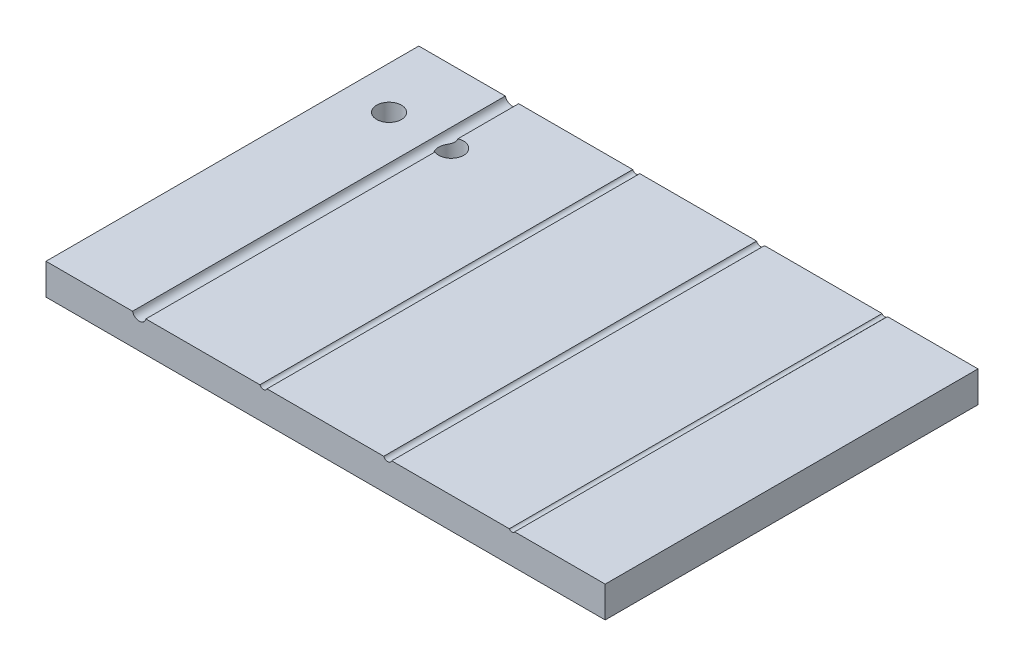
ISO-10303-21;
HEADER;
FILE_DESCRIPTION(('STEP AP214'),'2;1');
FILE_NAME('part.step','',(''),(''),'','','');
FILE_SCHEMA(('AUTOMOTIVE_DESIGN { 1 0 10303 214 1 1 1 1 }'));
ENDSEC;
DATA;
#1=APPLICATION_CONTEXT('core data for automotive mechanical design processes');
#2=APPLICATION_PROTOCOL_DEFINITION('international standard','automotive_design',2000,#1);
#3=PRODUCT_CONTEXT('',#1,'mechanical');
#4=PRODUCT('Part','Part','',(#3));
#5=PRODUCT_RELATED_PRODUCT_CATEGORY('part','',(#4));
#6=PRODUCT_DEFINITION_FORMATION('','',#4);
#7=PRODUCT_DEFINITION_CONTEXT('part definition',#1,'design');
#8=PRODUCT_DEFINITION('design','',#6,#7);
#9=PRODUCT_DEFINITION_SHAPE('','',#8);
#10=(LENGTH_UNIT() NAMED_UNIT(*) SI_UNIT(.MILLI.,.METRE.));
#11=(NAMED_UNIT(*) PLANE_ANGLE_UNIT() SI_UNIT($,.RADIAN.));
#12=(NAMED_UNIT(*) SI_UNIT($,.STERADIAN.) SOLID_ANGLE_UNIT());
#13=UNCERTAINTY_MEASURE_WITH_UNIT(LENGTH_MEASURE(1.E-05),#10,'distance_accuracy_value','');
#14=(GEOMETRIC_REPRESENTATION_CONTEXT(3) GLOBAL_UNCERTAINTY_ASSIGNED_CONTEXT((#13)) GLOBAL_UNIT_ASSIGNED_CONTEXT((#10,
#11,#12)) REPRESENTATION_CONTEXT('',''));
#15=CARTESIAN_POINT('',(0.,0.,0.));
#16=DIRECTION('',(0.,0.,1.));
#17=DIRECTION('',(1.,0.,0.));
#18=AXIS2_PLACEMENT_3D('',#15,#16,#17);
#19=CARTESIAN_POINT('',(0.,5.,0.));
#20=DIRECTION('',(0.,1.,0.));
#21=DIRECTION('',(0.,0.,1.));
#22=AXIS2_PLACEMENT_3D('',#19,#20,#21);
#23=PLANE('',#22);
#24=DIRECTION('',(0.,0.,1.));
#25=VECTOR('',#24,1.);
#26=CARTESIAN_POINT('',(-6.39332612607132,5.,-92.0754716981132));
#27=LINE('',#26,#25);
#28=CARTESIAN_POINT('',(-6.39332612607132,5.,-92.0754716981132));
#29=VERTEX_POINT('',#28);
#30=CARTESIAN_POINT('',(-6.39332612607132,5.,-32.0754716981132));
#31=VERTEX_POINT('',#30);
#32=EDGE_CURVE('E184',#29,#31,#27,.T.);
#33=ORIENTED_EDGE('',*,*,#32,.F.);
#34=DIRECTION('',(-1.,0.,0.));
#35=VECTOR('',#34,1.);
#36=CARTESIAN_POINT('',(-60.7547169811321,5.,-92.0754716981132));
#37=LINE('',#36,#35);
#38=CARTESIAN_POINT('',(-25.1873546630319,5.,-92.0754716981132));
#39=VERTEX_POINT('',#38);
#40=EDGE_CURVE('E211',#29,#39,#37,.T.);
#41=ORIENTED_EDGE('',*,*,#40,.T.);
#42=DIRECTION('',(0.,0.,1.));
#43=VECTOR('',#42,1.);
#44=CARTESIAN_POINT('',(-25.1873546630319,5.,-92.0754716981132));
#45=LINE('',#44,#43);
#46=CARTESIAN_POINT('',(-25.187354663032,5.,-32.0754716981132));
#47=VERTEX_POINT('',#46);
#48=EDGE_CURVE('E148',#47,#39,#45,.F.);
#49=ORIENTED_EDGE('',*,*,#48,.F.);
#50=DIRECTION('',(1.,0.,0.));
#51=VECTOR('',#50,1.);
#52=CARTESIAN_POINT('',(-60.7547169811321,5.,-32.0754716981132));
#53=LINE('',#52,#51);
#54=EDGE_CURVE('E245',#47,#31,#53,.T.);
#55=ORIENTED_EDGE('',*,*,#54,.T.);
#56=EDGE_LOOP('',(#33,#41,#49,#55));
#57=FACE_BOUND('',#56,.T.);
#58=ADVANCED_FACE('F33',(#57),#23,.T.);
#59=DIRECTION('',(0.,0.,1.));
#60=VECTOR('',#59,1.);
#61=CARTESIAN_POINT('',(-5.11610783619289,5.,-92.0754716981132));
#62=LINE('',#61,#60);
#63=CARTESIAN_POINT('',(-5.11610783619289,5.,-32.0754716981132));
#64=VERTEX_POINT('',#63);
#65=CARTESIAN_POINT('',(-5.11610783619289,5.,-92.0754716981132));
#66=VERTEX_POINT('',#65);
#67=EDGE_CURVE('E59',#64,#66,#62,.F.);
#68=ORIENTED_EDGE('',*,*,#67,.F.);
#69=CARTESIAN_POINT('',(13.8122703169757,5.,-32.0754716981132));
#70=VERTEX_POINT('',#69);
#71=EDGE_CURVE('E176',#64,#70,#53,.T.);
#72=ORIENTED_EDGE('',*,*,#71,.T.);
#73=DIRECTION('',(0.,0.,1.));
#74=VECTOR('',#73,1.);
#75=CARTESIAN_POINT('',(13.8122703169757,5.,-92.0754716981132));
#76=LINE('',#75,#74);
#77=CARTESIAN_POINT('',(13.8122703169757,5.,-92.0754716981132));
#78=VERTEX_POINT('',#77);
#79=EDGE_CURVE('E46',#78,#70,#76,.T.);
#80=ORIENTED_EDGE('',*,*,#79,.F.);
#81=EDGE_CURVE('E210',#78,#66,#37,.T.);
#82=ORIENTED_EDGE('',*,*,#81,.T.);
#83=EDGE_LOOP('',(#68,#72,#80,#82));
#84=FACE_BOUND('',#83,.T.);
#85=ADVANCED_FACE('F268',(#84),#23,.T.);
#86=CARTESIAN_POINT('',(-43.9074445790177,5.,-80.4423119631146));
#87=DIRECTION('',(0.,1.,0.));
#88=DIRECTION('',(0.,0.,1.));
#89=AXIS2_PLACEMENT_3D('',#86,#87,#88);
#90=CIRCLE('',#89,2.);
#91=CARTESIAN_POINT('',(-44.6835027168507,5.,-78.5990176928736));
#92=VERTEX_POINT('',#91);
#93=CARTESIAN_POINT('',(-44.6835027168507,5.,-82.2856062333556));
#94=VERTEX_POINT('',#93);
#95=EDGE_CURVE('E52',#92,#94,#90,.T.);
#96=ORIENTED_EDGE('',*,*,#95,.F.);
#97=DIRECTION('',(0.,0.,1.));
#98=VECTOR('',#97,1.);
#99=CARTESIAN_POINT('',(-44.6835027168507,5.,-92.0754716981132));
#100=LINE('',#99,#98);
#101=CARTESIAN_POINT('',(-44.6835027168507,5.,-32.0754716981132));
#102=VERTEX_POINT('',#101);
#103=EDGE_CURVE('E137',#102,#92,#100,.F.);
#104=ORIENTED_EDGE('',*,*,#103,.F.);
#105=CARTESIAN_POINT('',(-26.3220792992323,5.,-32.0754716981132));
#106=VERTEX_POINT('',#105);
#107=EDGE_CURVE('E203',#102,#106,#53,.T.);
#108=ORIENTED_EDGE('',*,*,#107,.T.);
#109=DIRECTION('',(0.,0.,1.));
#110=VECTOR('',#109,1.);
#111=CARTESIAN_POINT('',(-26.3220792992323,5.,-92.0754716981132));
#112=LINE('',#111,#110);
#113=CARTESIAN_POINT('',(-26.3220792992323,5.,-92.0754716981132));
#114=VERTEX_POINT('',#113);
#115=EDGE_CURVE('E156',#114,#106,#112,.T.);
#116=ORIENTED_EDGE('',*,*,#115,.F.);
#117=CARTESIAN_POINT('',(-44.6835027168507,5.,-92.0754716981132));
#118=VERTEX_POINT('',#117);
#119=EDGE_CURVE('E256',#114,#118,#37,.T.);
#120=ORIENTED_EDGE('',*,*,#119,.T.);
#121=EDGE_CURVE('E140',#94,#118,#100,.F.);
#122=ORIENTED_EDGE('',*,*,#121,.F.);
#123=EDGE_LOOP('',(#96,#104,#108,#116,#120,#122));
#124=FACE_BOUND('',#123,.T.);
#125=ADVANCED_FACE('F135',(#124),#23,.T.);
#126=CARTESIAN_POINT('',(-53.9074445790177,5.,-80.4423119631146));
#127=DIRECTION('',(0.,1.,0.));
#128=DIRECTION('',(0.,0.,1.));
#129=AXIS2_PLACEMENT_3D('',#126,#127,#128);
#130=CIRCLE('',#129,2.);
#131=CARTESIAN_POINT('',(-53.9074445790177,5.,-78.4423119631146));
#132=VERTEX_POINT('',#131);
#133=EDGE_CURVE('E284',#132,#132,#130,.T.);
#134=ORIENTED_EDGE('',*,*,#133,.F.);
#135=EDGE_LOOP('',(#134));
#136=FACE_BOUND('',#135,.T.);
#137=DIRECTION('',(0.,0.,1.));
#138=VECTOR('',#137,1.);
#139=CARTESIAN_POINT('',(-46.8259312454135,5.,-92.0754716981132));
#140=LINE('',#139,#138);
#141=CARTESIAN_POINT('',(-46.8259312454135,5.,-92.0754716981132));
#142=VERTEX_POINT('',#141);
#143=CARTESIAN_POINT('',(-46.8259312454135,5.,-32.0754716981132));
#144=VERTEX_POINT('',#143);
#145=EDGE_CURVE('E146',#142,#144,#140,.T.);
#146=ORIENTED_EDGE('',*,*,#145,.F.);
#147=CARTESIAN_POINT('',(-60.7547169811321,5.,-92.0754716981132));
#148=VERTEX_POINT('',#147);
#149=EDGE_CURVE('E205',#142,#148,#37,.T.);
#150=ORIENTED_EDGE('',*,*,#149,.T.);
#151=DIRECTION('',(0.,0.,1.));
#152=VECTOR('',#151,1.);
#153=CARTESIAN_POINT('',(-60.7547169811321,5.,-92.0754716981132));
#154=LINE('',#153,#152);
#155=CARTESIAN_POINT('',(-60.7547169811321,5.,-32.0754716981132));
#156=VERTEX_POINT('',#155);
#157=EDGE_CURVE('E195',#148,#156,#154,.T.);
#158=ORIENTED_EDGE('',*,*,#157,.T.);
#159=EDGE_CURVE('E199',#156,#144,#53,.T.);
#160=ORIENTED_EDGE('',*,*,#159,.T.);
#161=EDGE_LOOP('',(#146,#150,#158,#160));
#162=FACE_BOUND('',#161,.T.);
#163=ADVANCED_FACE('F260',(#136,#162),#23,.T.);
#164=CARTESIAN_POINT('',(-60.7547169811321,5.,-92.0754716981132));
#165=DIRECTION('',(1.,0.,0.));
#166=DIRECTION('',(0.,0.,-1.));
#167=AXIS2_PLACEMENT_3D('',#164,#165,#166);
#168=PLANE('',#167);
#169=DIRECTION('',(0.,0.,1.));
#170=VECTOR('',#169,1.);
#171=CARTESIAN_POINT('',(-60.7547169811321,0.,-92.0754716981132));
#172=LINE('',#171,#170);
#173=CARTESIAN_POINT('',(-60.7547169811321,0.,-92.0754716981132));
#174=VERTEX_POINT('',#173);
#175=CARTESIAN_POINT('',(-60.7547169811321,0.,-32.0754716981132));
#176=VERTEX_POINT('',#175);
#177=EDGE_CURVE('E193',#174,#176,#172,.T.);
#178=ORIENTED_EDGE('',*,*,#177,.T.);
#179=DIRECTION('',(0.,-1.,0.));
#180=VECTOR('',#179,1.);
#181=CARTESIAN_POINT('',(-60.7547169811321,5.,-32.0754716981132));
#182=LINE('',#181,#180);
#183=EDGE_CURVE('E150',#156,#176,#182,.T.);
#184=ORIENTED_EDGE('',*,*,#183,.F.);
#185=ORIENTED_EDGE('',*,*,#157,.F.);
#186=DIRECTION('',(0.,-1.,0.));
#187=VECTOR('',#186,1.);
#188=CARTESIAN_POINT('',(-60.7547169811321,5.,-92.0754716981132));
#189=LINE('',#188,#187);
#190=EDGE_CURVE('E209',#148,#174,#189,.T.);
#191=ORIENTED_EDGE('',*,*,#190,.T.);
#192=EDGE_LOOP('',(#178,#184,#185,#191));
#193=FACE_BOUND('',#192,.T.);
#194=ADVANCED_FACE('F35',(#193),#168,.F.);
#195=CARTESIAN_POINT('',(-60.7547169811321,5.,-32.0754716981132));
#196=DIRECTION('',(0.,0.,-1.));
#197=DIRECTION('',(-1.,0.,0.));
#198=AXIS2_PLACEMENT_3D('',#195,#196,#197);
#199=PLANE('',#198);
#200=ORIENTED_EDGE('',*,*,#71,.F.);
#201=CARTESIAN_POINT('',(-5.75471698113211,5.25,-32.0754716981132));
#202=DIRECTION('',(0.,0.,1.));
#203=DIRECTION('',(1.,0.,0.));
#204=AXIS2_PLACEMENT_3D('',#201,#202,#203);
#205=CIRCLE('',#204,0.6858);
#206=EDGE_CURVE('E278',#31,#64,#205,.T.);
#207=ORIENTED_EDGE('',*,*,#206,.F.);
#208=ORIENTED_EDGE('',*,*,#54,.F.);
#209=CARTESIAN_POINT('',(-25.7547169811321,5.25,-32.0754716981132));
#210=DIRECTION('',(0.,0.,1.));
#211=DIRECTION('',(1.,0.,0.));
#212=AXIS2_PLACEMENT_3D('',#209,#210,#211);
#213=CIRCLE('',#212,0.62);
#214=EDGE_CURVE('E182',#106,#47,#213,.T.);
#215=ORIENTED_EDGE('',*,*,#214,.F.);
#216=ORIENTED_EDGE('',*,*,#107,.F.);
#217=CARTESIAN_POINT('',(-45.7547169811321,5.25,-32.0754716981132));
#218=DIRECTION('',(0.,0.,1.));
#219=DIRECTION('',(1.,0.,0.));
#220=AXIS2_PLACEMENT_3D('',#217,#218,#219);
#221=CIRCLE('',#220,1.1);
#222=EDGE_CURVE('E145',#144,#102,#221,.T.);
#223=ORIENTED_EDGE('',*,*,#222,.F.);
#224=ORIENTED_EDGE('',*,*,#159,.F.);
#225=ORIENTED_EDGE('',*,*,#183,.T.);
#226=DIRECTION('',(1.,0.,0.));
#227=VECTOR('',#226,1.);
#228=CARTESIAN_POINT('',(-60.7547169811321,0.,-32.0754716981132));
#229=LINE('',#228,#227);
#230=CARTESIAN_POINT('',(29.2452830188679,0.,-32.0754716981132));
#231=VERTEX_POINT('',#230);
#232=EDGE_CURVE('E214',#176,#231,#229,.T.);
#233=ORIENTED_EDGE('',*,*,#232,.T.);
#234=DIRECTION('',(0.,-1.,0.));
#235=VECTOR('',#234,1.);
#236=CARTESIAN_POINT('',(29.2452830188679,5.,-32.0754716981132));
#237=LINE('',#236,#235);
#238=CARTESIAN_POINT('',(29.2452830188679,5.,-32.0754716981132));
#239=VERTEX_POINT('',#238);
#240=EDGE_CURVE('E223',#239,#231,#237,.T.);
#241=ORIENTED_EDGE('',*,*,#240,.F.);
#242=CARTESIAN_POINT('',(14.6782957207601,5.,-32.0754716981132));
#243=VERTEX_POINT('',#242);
#244=EDGE_CURVE('E178',#243,#239,#53,.T.);
#245=ORIENTED_EDGE('',*,*,#244,.F.);
#246=CARTESIAN_POINT('',(14.2452830188679,5.25,-32.0754716981132));
#247=DIRECTION('',(0.,0.,1.));
#248=DIRECTION('',(1.,0.,0.));
#249=AXIS2_PLACEMENT_3D('',#246,#247,#248);
#250=CIRCLE('',#249,0.499999999999999);
#251=EDGE_CURVE('E164',#70,#243,#250,.T.);
#252=ORIENTED_EDGE('',*,*,#251,.F.);
#253=EDGE_LOOP('',(#200,#207,#208,#215,#216,#223,#224,#225,#233,#241,#245,#252));
#254=FACE_BOUND('',#253,.T.);
#255=ADVANCED_FACE('F174',(#254),#199,.F.);
#256=CARTESIAN_POINT('',(29.2452830188679,5.,-92.0754716981132));
#257=DIRECTION('',(-1.,0.,0.));
#258=DIRECTION('',(0.,0.,1.));
#259=AXIS2_PLACEMENT_3D('',#256,#257,#258);
#260=PLANE('',#259);
#261=DIRECTION('',(0.,0.,-1.));
#262=VECTOR('',#261,1.);
#263=CARTESIAN_POINT('',(29.2452830188679,0.,-92.0754716981132));
#264=LINE('',#263,#262);
#265=CARTESIAN_POINT('',(29.2452830188679,0.,-92.0754716981132));
#266=VERTEX_POINT('',#265);
#267=EDGE_CURVE('E216',#231,#266,#264,.T.);
#268=ORIENTED_EDGE('',*,*,#267,.T.);
#269=DIRECTION('',(0.,-1.,0.));
#270=VECTOR('',#269,1.);
#271=CARTESIAN_POINT('',(29.2452830188679,5.,-92.0754716981132));
#272=LINE('',#271,#270);
#273=CARTESIAN_POINT('',(29.2452830188679,5.,-92.0754716981132));
#274=VERTEX_POINT('',#273);
#275=EDGE_CURVE('E221',#274,#266,#272,.T.);
#276=ORIENTED_EDGE('',*,*,#275,.F.);
#277=DIRECTION('',(0.,0.,-1.));
#278=VECTOR('',#277,1.);
#279=CARTESIAN_POINT('',(29.2452830188679,5.,-92.0754716981132));
#280=LINE('',#279,#278);
#281=EDGE_CURVE('E202',#239,#274,#280,.T.);
#282=ORIENTED_EDGE('',*,*,#281,.F.);
#283=ORIENTED_EDGE('',*,*,#240,.T.);
#284=EDGE_LOOP('',(#268,#276,#282,#283));
#285=FACE_BOUND('',#284,.T.);
#286=ADVANCED_FACE('F238',(#285),#260,.F.);
#287=CARTESIAN_POINT('',(-60.7547169811321,5.,-92.0754716981132));
#288=DIRECTION('',(0.,0.,1.));
#289=DIRECTION('',(1.,0.,0.));
#290=AXIS2_PLACEMENT_3D('',#287,#288,#289);
#291=PLANE('',#290);
#292=ORIENTED_EDGE('',*,*,#40,.F.);
#293=CARTESIAN_POINT('',(-5.75471698113211,5.25,-92.0754716981132));
#294=DIRECTION('',(0.,0.,1.));
#295=DIRECTION('',(1.,0.,0.));
#296=AXIS2_PLACEMENT_3D('',#293,#294,#295);
#297=CIRCLE('',#296,0.6858);
#298=EDGE_CURVE('E279',#29,#66,#297,.T.);
#299=ORIENTED_EDGE('',*,*,#298,.T.);
#300=ORIENTED_EDGE('',*,*,#81,.F.);
#301=CARTESIAN_POINT('',(14.2452830188679,5.25,-92.0754716981132));
#302=DIRECTION('',(0.,0.,1.));
#303=DIRECTION('',(1.,0.,0.));
#304=AXIS2_PLACEMENT_3D('',#301,#302,#303);
#305=CIRCLE('',#304,0.499999999999999);
#306=CARTESIAN_POINT('',(14.6782957207601,5.,-92.0754716981132));
#307=VERTEX_POINT('',#306);
#308=EDGE_CURVE('E167',#78,#307,#305,.T.);
#309=ORIENTED_EDGE('',*,*,#308,.T.);
#310=EDGE_CURVE('E206',#274,#307,#37,.T.);
#311=ORIENTED_EDGE('',*,*,#310,.F.);
#312=ORIENTED_EDGE('',*,*,#275,.T.);
#313=DIRECTION('',(-1.,0.,0.));
#314=VECTOR('',#313,1.);
#315=CARTESIAN_POINT('',(-60.7547169811321,0.,-92.0754716981132));
#316=LINE('',#315,#314);
#317=EDGE_CURVE('E198',#266,#174,#316,.T.);
#318=ORIENTED_EDGE('',*,*,#317,.T.);
#319=ORIENTED_EDGE('',*,*,#190,.F.);
#320=ORIENTED_EDGE('',*,*,#149,.F.);
#321=CARTESIAN_POINT('',(-45.7547169811321,5.25,-92.0754716981132));
#322=DIRECTION('',(0.,0.,1.));
#323=DIRECTION('',(1.,0.,0.));
#324=AXIS2_PLACEMENT_3D('',#321,#322,#323);
#325=CIRCLE('',#324,1.1);
#326=EDGE_CURVE('E190',#142,#118,#325,.T.);
#327=ORIENTED_EDGE('',*,*,#326,.T.);
#328=ORIENTED_EDGE('',*,*,#119,.F.);
#329=CARTESIAN_POINT('',(-25.7547169811321,5.25,-92.0754716981132));
#330=DIRECTION('',(0.,0.,1.));
#331=DIRECTION('',(1.,0.,0.));
#332=AXIS2_PLACEMENT_3D('',#329,#330,#331);
#333=CIRCLE('',#332,0.62);
#334=EDGE_CURVE('E179',#114,#39,#333,.T.);
#335=ORIENTED_EDGE('',*,*,#334,.T.);
#336=EDGE_LOOP('',(#292,#299,#300,#309,#311,#312,#318,#319,#320,#327,#328,#335));
#337=FACE_BOUND('',#336,.T.);
#338=ADVANCED_FACE('F242',(#337),#291,.F.);
#339=DIRECTION('',(0.,0.,1.));
#340=VECTOR('',#339,1.);
#341=CARTESIAN_POINT('',(14.6782957207601,5.,-92.0754716981132));
#342=LINE('',#341,#340);
#343=EDGE_CURVE('E158',#243,#307,#342,.F.);
#344=ORIENTED_EDGE('',*,*,#343,.F.);
#345=ORIENTED_EDGE('',*,*,#244,.T.);
#346=ORIENTED_EDGE('',*,*,#281,.T.);
#347=ORIENTED_EDGE('',*,*,#310,.T.);
#348=EDGE_LOOP('',(#344,#345,#346,#347));
#349=FACE_BOUND('',#348,.T.);
#350=ADVANCED_FACE('F244',(#349),#23,.T.);
#351=CARTESIAN_POINT('',(0.,0.,0.));
#352=DIRECTION('',(0.,1.,0.));
#353=DIRECTION('',(0.,0.,1.));
#354=AXIS2_PLACEMENT_3D('',#351,#352,#353);
#355=PLANE('',#354);
#356=CARTESIAN_POINT('',(-43.9074445790177,0.,-80.4423119631146));
#357=DIRECTION('',(0.,1.,0.));
#358=DIRECTION('',(0.,0.,1.));
#359=AXIS2_PLACEMENT_3D('',#356,#357,#358);
#360=CIRCLE('',#359,2.);
#361=CARTESIAN_POINT('',(-43.9074445790177,0.,-78.4423119631146));
#362=VERTEX_POINT('',#361);
#363=EDGE_CURVE('E141',#362,#362,#360,.T.);
#364=ORIENTED_EDGE('',*,*,#363,.T.);
#365=EDGE_LOOP('',(#364));
#366=FACE_BOUND('',#365,.T.);
#367=CARTESIAN_POINT('',(-53.9074445790177,0.,-80.4423119631146));
#368=DIRECTION('',(0.,1.,0.));
#369=DIRECTION('',(0.,0.,1.));
#370=AXIS2_PLACEMENT_3D('',#367,#368,#369);
#371=CIRCLE('',#370,2.);
#372=CARTESIAN_POINT('',(-53.9074445790177,0.,-78.4423119631146));
#373=VERTEX_POINT('',#372);
#374=EDGE_CURVE('E282',#373,#373,#371,.T.);
#375=ORIENTED_EDGE('',*,*,#374,.T.);
#376=EDGE_LOOP('',(#375));
#377=FACE_BOUND('',#376,.T.);
#378=ORIENTED_EDGE('',*,*,#177,.F.);
#379=ORIENTED_EDGE('',*,*,#317,.F.);
#380=ORIENTED_EDGE('',*,*,#267,.F.);
#381=ORIENTED_EDGE('',*,*,#232,.F.);
#382=EDGE_LOOP('',(#378,#379,#380,#381));
#383=FACE_BOUND('',#382,.T.);
#384=ADVANCED_FACE('F236',(#366,#377,#383),#355,.F.);
#385=CARTESIAN_POINT('',(-45.7547169811321,5.25,-92.0754716981132));
#386=DIRECTION('',(0.,0.,1.));
#387=DIRECTION('',(1.,0.,0.));
#388=AXIS2_PLACEMENT_3D('',#385,#386,#387);
#389=CYLINDRICAL_SURFACE('',#388,1.1);
#390=ORIENTED_EDGE('',*,*,#103,.T.);
#391=CARTESIAN_POINT('',(-44.6835027168507,5.,-78.5990176928736));
#392=CARTESIAN_POINT('',(-44.6899202354543,4.97249693888929,-78.6017229261327));
#393=CARTESIAN_POINT('',(-44.6973867702952,4.94529859888722,-78.6049023768884));
#394=CARTESIAN_POINT('',(-44.7143340497925,4.89167834483306,-78.6122798460931));
#395=CARTESIAN_POINT('',(-44.7238148300667,4.86525644452006,-78.6164778825538));
#396=CARTESIAN_POINT('',(-44.755105212997,4.78752456299856,-78.630683482873));
#397=CARTESIAN_POINT('',(-44.7797926277288,4.73762265022467,-78.6423141367367));
#398=CARTESIAN_POINT('',(-44.8356633236478,4.64307073078245,-78.6704812366692));
#399=CARTESIAN_POINT('',(-44.8668541361028,4.59842690788634,-78.6870233799952));
#400=CARTESIAN_POINT('',(-44.9340600321087,4.51558603733215,-78.7254679644335));
#401=CARTESIAN_POINT('',(-44.9700722476337,4.47738518734798,-78.7473672252057));
#402=CARTESIAN_POINT('',(-45.0448852429407,4.40813654534841,-78.7966430804185));
#403=CARTESIAN_POINT('',(-45.083679602505,4.37707293839956,-78.824007308718));
#404=CARTESIAN_POINT('',(-45.1621472410909,4.32201144625727,-78.8840552738125));
#405=CARTESIAN_POINT('',(-45.2018209620422,4.29801720455781,-78.9167417402191));
#406=CARTESIAN_POINT('',(-45.2833585952313,4.25495544666789,-78.9897005794939));
#407=CARTESIAN_POINT('',(-45.3251495151025,4.2364234898411,-79.0303672923556));
#408=CARTESIAN_POINT('',(-45.4060264918933,4.20583149136189,-79.1165073695616));
#409=CARTESIAN_POINT('',(-45.4451106677455,4.19377591195951,-79.1619840222181));
#410=CARTESIAN_POINT('',(-45.5401750325229,4.16946638099021,-79.2834403906024));
#411=CARTESIAN_POINT('',(-45.5934272684518,4.16084872390531,-79.3622912314042));
#412=CARTESIAN_POINT('',(-45.6883376645623,4.15096324643832,-79.5271453354249));
#413=CARTESIAN_POINT('',(-45.7299698932094,4.14971174159816,-79.6131640482974));
#414=CARTESIAN_POINT('',(-45.8014356155745,4.15039781180992,-79.79243594328));
#415=CARTESIAN_POINT('',(-45.8309471771439,4.15241611706885,-79.8858164244188));
#416=CARTESIAN_POINT('',(-45.8760021880223,4.15646826533132,-80.0758408929611));
#417=CARTESIAN_POINT('',(-45.8915563491759,4.1585020952091,-80.1724823184876));
#418=CARTESIAN_POINT('',(-45.9048245363375,4.16028450586061,-80.3255758310919));
#419=CARTESIAN_POINT('',(-45.9073116441858,4.16063701658732,-80.3816480328067));
#420=CARTESIAN_POINT('',(-45.9075670344482,4.16066990581624,-80.493819774386));
#421=CARTESIAN_POINT('',(-45.9053348410977,4.16035021655232,-80.5499193164366));
#422=CARTESIAN_POINT('',(-45.8961593748739,4.15912213948255,-80.6617827628682));
#423=CARTESIAN_POINT('',(-45.889211024418,4.15821311722717,-80.7175462400809));
#424=CARTESIAN_POINT('',(-45.8706468658426,4.15608611250328,-80.8283051069353));
#425=CARTESIAN_POINT('',(-45.8590294048463,4.15486802067973,-80.8833002174317));
#426=CARTESIAN_POINT('',(-45.8312335952536,4.15257619647291,-80.9920192196193));
#427=CARTESIAN_POINT('',(-45.8150638205139,4.15150219826428,-81.045745297189));
#428=CARTESIAN_POINT('',(-45.7782657803961,4.15009803766131,-81.1516572926586));
#429=CARTESIAN_POINT('',(-45.7576377806034,4.14976783097118,-81.203843302093));
#430=CARTESIAN_POINT('',(-45.7120999685696,4.15059033186999,-81.3062288040314));
#431=CARTESIAN_POINT('',(-45.6871958139751,4.15174109293959,-81.3564308148927));
#432=CARTESIAN_POINT('',(-45.6333276758143,4.15638463255587,-81.4544661789247));
#433=CARTESIAN_POINT('',(-45.6043656120621,4.15987630654635,-81.5023006377957));
#434=CARTESIAN_POINT('',(-45.532000158388,4.17195876389753,-81.6112601349317));
#435=CARTESIAN_POINT('',(-45.4870696321163,4.18189694784902,-81.6712488953091));
#436=CARTESIAN_POINT('',(-45.3919274807122,4.2103674383514,-81.7846086866571));
#437=CARTESIAN_POINT('',(-45.3417248915953,4.22888522003151,-81.8379907097486));
#438=CARTESIAN_POINT('',(-45.2477124418387,4.27268840670512,-81.9279586829939));
#439=CARTESIAN_POINT('',(-45.2043347377399,4.29620651159792,-81.9658467894784));
#440=CARTESIAN_POINT('',(-45.1179071663152,4.35161233431556,-82.0353749958531));
#441=CARTESIAN_POINT('',(-45.0748570664194,4.38349340435574,-82.0670200235631));
#442=CARTESIAN_POINT('',(-44.9914382966377,4.45597926671951,-82.1238359299624));
#443=CARTESIAN_POINT('',(-44.9510833409129,4.49662479389405,-82.1489753291886));
#444=CARTESIAN_POINT('',(-44.8759084585409,4.58584624005723,-82.1927345045864));
#445=CARTESIAN_POINT('',(-44.8410920769248,4.63442719822214,-82.2113501142231));
#446=CARTESIAN_POINT('',(-44.7816457708162,4.73402533071047,-82.2414230819583));
#447=CARTESIAN_POINT('',(-44.756435455643,4.78456179206419,-82.2533234446319));
#448=CARTESIAN_POINT('',(-44.7245197894442,4.86334406647258,-82.2678320956828));
#449=CARTESIAN_POINT('',(-44.7148576340438,4.890130218124,-82.2721140127344));
#450=CARTESIAN_POINT('',(-44.6976043067079,4.94450646684998,-82.279628838098));
#451=CARTESIAN_POINT('',(-44.6900132476803,4.97209660766408,-82.282861689221));
#452=CARTESIAN_POINT('',(-44.6835027168507,5.,-82.2856062333556));
#453=B_SPLINE_CURVE_WITH_KNOTS('',3,(#391,#392,#393,#394,#395,#396,#397,#398,#399,#400,#401,
#402,#403,#404,#405,#406,#407,#408,#409,#410,#411,#412,#413,#414,#415,#416,#417,#418,#419,#420,
#421,#422,#423,#424,#425,#426,#427,#428,#429,#430,#431,#432,#433,#434,#435,#436,#437,#438,#439,
#440,#441,#442,#443,#444,#445,#446,#447,#448,#449,#450,#451,#452),.UNSPECIFIED.,.F.,.F.,(4,2,2,
2,2,2,2,2,2,2,2,2,2,2,2,2,2,2,2,2,2,2,2,2,2,2,2,2,2,2,4),(0.,0.0850623500026699,
0.170126204279844,0.339869636160493,0.50981074241212,0.679651204161093,0.849111618316892,
1.01865921883604,1.20153488381798,1.38453638978567,1.66956037222128,1.9552154271306,
2.24803127424552,2.5406222021751,2.70883063436269,2.87705602486724,3.04546282070592,
3.21392928555133,3.38208055815008,3.5502218163979,3.71814230266027,3.88598361160893,
4.11196799339067,4.33757118399132,4.52342421803114,4.70912996142544,4.89571817068717,
5.08242533159224,5.25466049882941,5.34095603679835,5.42725627831368),.UNSPECIFIED.);
#454=EDGE_CURVE('E11',#92,#94,#453,.T.);
#455=ORIENTED_EDGE('',*,*,#454,.T.);
#456=ORIENTED_EDGE('',*,*,#121,.T.);
#457=ORIENTED_EDGE('',*,*,#326,.F.);
#458=ORIENTED_EDGE('',*,*,#145,.T.);
#459=ORIENTED_EDGE('',*,*,#222,.T.);
#460=EDGE_LOOP('',(#390,#455,#456,#457,#458,#459));
#461=FACE_BOUND('',#460,.T.);
#462=ADVANCED_FACE('F143',(#461),#389,.F.);
#463=CARTESIAN_POINT('',(-25.7547169811321,5.25,-92.0754716981132));
#464=DIRECTION('',(0.,0.,1.));
#465=DIRECTION('',(1.,0.,0.));
#466=AXIS2_PLACEMENT_3D('',#463,#464,#465);
#467=CYLINDRICAL_SURFACE('',#466,0.62);
#468=ORIENTED_EDGE('',*,*,#115,.T.);
#469=ORIENTED_EDGE('',*,*,#214,.T.);
#470=ORIENTED_EDGE('',*,*,#48,.T.);
#471=ORIENTED_EDGE('',*,*,#334,.F.);
#472=EDGE_LOOP('',(#468,#469,#470,#471));
#473=FACE_BOUND('',#472,.T.);
#474=ADVANCED_FACE('F255',(#473),#467,.F.);
#475=CARTESIAN_POINT('',(14.2452830188679,5.25,-92.0754716981132));
#476=DIRECTION('',(0.,0.,1.));
#477=DIRECTION('',(1.,0.,0.));
#478=AXIS2_PLACEMENT_3D('',#475,#476,#477);
#479=CYLINDRICAL_SURFACE('',#478,0.499999999999999);
#480=ORIENTED_EDGE('',*,*,#79,.T.);
#481=ORIENTED_EDGE('',*,*,#251,.T.);
#482=ORIENTED_EDGE('',*,*,#343,.T.);
#483=ORIENTED_EDGE('',*,*,#308,.F.);
#484=EDGE_LOOP('',(#480,#481,#482,#483));
#485=FACE_BOUND('',#484,.T.);
#486=ADVANCED_FACE('F163',(#485),#479,.F.);
#487=CARTESIAN_POINT('',(-5.75471698113211,5.25,-92.0754716981132));
#488=DIRECTION('',(0.,0.,1.));
#489=DIRECTION('',(1.,0.,0.));
#490=AXIS2_PLACEMENT_3D('',#487,#488,#489);
#491=CYLINDRICAL_SURFACE('',#490,0.6858);
#492=ORIENTED_EDGE('',*,*,#32,.T.);
#493=ORIENTED_EDGE('',*,*,#206,.T.);
#494=ORIENTED_EDGE('',*,*,#67,.T.);
#495=ORIENTED_EDGE('',*,*,#298,.F.);
#496=EDGE_LOOP('',(#492,#493,#494,#495));
#497=FACE_BOUND('',#496,.T.);
#498=ADVANCED_FACE('F299',(#497),#491,.F.);
#499=CARTESIAN_POINT('',(-53.9074445790177,0.,-80.4423119631146));
#500=DIRECTION('',(0.,1.,0.));
#501=DIRECTION('',(0.,0.,1.));
#502=AXIS2_PLACEMENT_3D('',#499,#500,#501);
#503=CYLINDRICAL_SURFACE('',#502,2.);
#504=ORIENTED_EDGE('',*,*,#374,.F.);
#505=EDGE_LOOP('',(#504));
#506=FACE_BOUND('',#505,.T.);
#507=ORIENTED_EDGE('',*,*,#133,.T.);
#508=EDGE_LOOP('',(#507));
#509=FACE_BOUND('',#508,.T.);
#510=ADVANCED_FACE('F295',(#506,#509),#503,.F.);
#511=CARTESIAN_POINT('',(-43.9074445790177,0.,-80.4423119631146));
#512=DIRECTION('',(0.,1.,0.));
#513=DIRECTION('',(0.,0.,1.));
#514=AXIS2_PLACEMENT_3D('',#511,#512,#513);
#515=CYLINDRICAL_SURFACE('',#514,2.);
#516=ORIENTED_EDGE('',*,*,#363,.F.);
#517=EDGE_LOOP('',(#516));
#518=FACE_BOUND('',#517,.T.);
#519=ORIENTED_EDGE('',*,*,#95,.T.);
#520=ORIENTED_EDGE('',*,*,#454,.F.);
#521=EDGE_LOOP('',(#519,#520));
#522=FACE_BOUND('',#521,.T.);
#523=ADVANCED_FACE('F129',(#518,#522),#515,.F.);
#524=CLOSED_SHELL('',(#58,#85,#125,#163,#194,#255,#286,#338,#350,#384,#462,#474,#486,#498,#510,#523));
#525=MANIFOLD_SOLID_BREP('B2',#524);
#526=ADVANCED_BREP_SHAPE_REPRESENTATION('',(#18,#525),#14);
#527=SHAPE_DEFINITION_REPRESENTATION(#9,#526);
ENDSEC;
END-ISO-10303-21;
